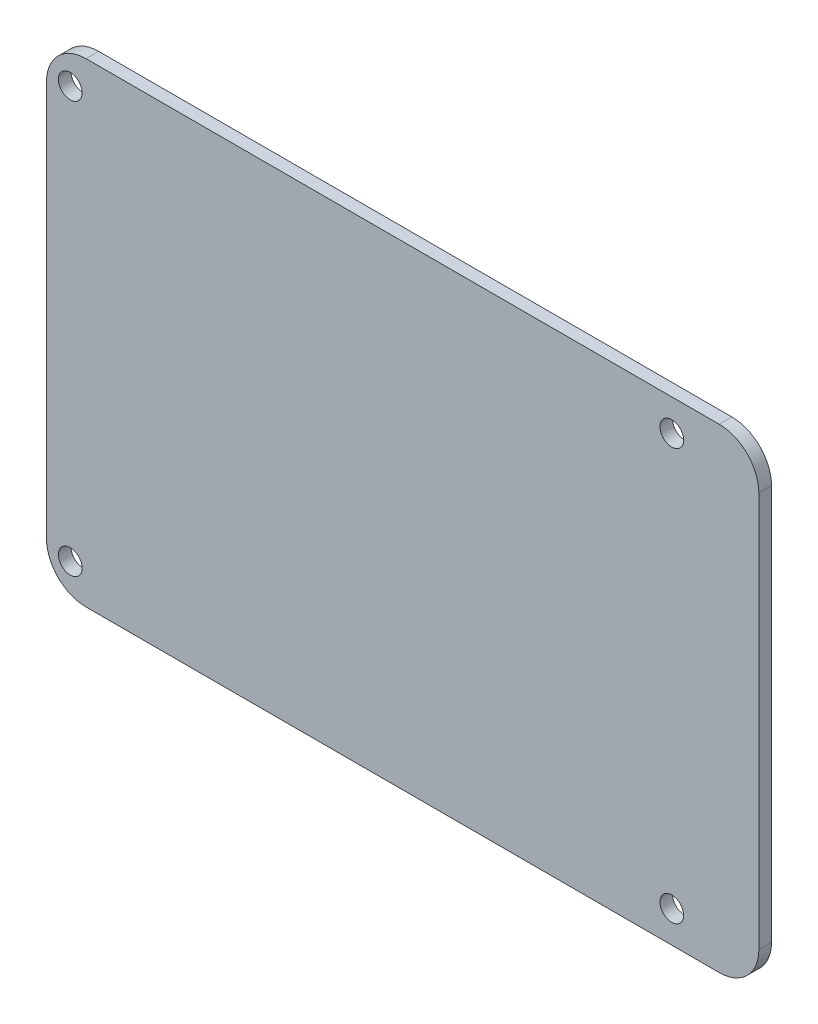
ISO-10303-21;
HEADER;
FILE_DESCRIPTION(('STEP AP214'),'2;1');
FILE_NAME('part.step','',(''),(''),'','','');
FILE_SCHEMA(('AUTOMOTIVE_DESIGN { 1 0 10303 214 1 1 1 1 }'));
ENDSEC;
DATA;
#1=APPLICATION_CONTEXT('core data for automotive mechanical design processes');
#2=APPLICATION_PROTOCOL_DEFINITION('international standard','automotive_design',2000,#1);
#3=PRODUCT_CONTEXT('',#1,'mechanical');
#4=PRODUCT('Part','Part','',(#3));
#5=PRODUCT_RELATED_PRODUCT_CATEGORY('part','',(#4));
#6=PRODUCT_DEFINITION_FORMATION('','',#4);
#7=PRODUCT_DEFINITION_CONTEXT('part definition',#1,'design');
#8=PRODUCT_DEFINITION('design','',#6,#7);
#9=PRODUCT_DEFINITION_SHAPE('','',#8);
#10=(LENGTH_UNIT() NAMED_UNIT(*) SI_UNIT(.MILLI.,.METRE.));
#11=(NAMED_UNIT(*) PLANE_ANGLE_UNIT() SI_UNIT($,.RADIAN.));
#12=(NAMED_UNIT(*) SI_UNIT($,.STERADIAN.) SOLID_ANGLE_UNIT());
#13=UNCERTAINTY_MEASURE_WITH_UNIT(LENGTH_MEASURE(1.E-05),#10,'distance_accuracy_value','');
#14=(GEOMETRIC_REPRESENTATION_CONTEXT(3) GLOBAL_UNCERTAINTY_ASSIGNED_CONTEXT((#13)) GLOBAL_UNIT_ASSIGNED_CONTEXT((#10,
#11,#12)) REPRESENTATION_CONTEXT('',''));
#15=CARTESIAN_POINT('',(0.,0.,0.));
#16=DIRECTION('',(0.,0.,1.));
#17=DIRECTION('',(1.,0.,0.));
#18=AXIS2_PLACEMENT_3D('',#15,#16,#17);
#19=CARTESIAN_POINT('',(0.,0.,1.6));
#20=DIRECTION('',(1.,0.,0.));
#21=DIRECTION('',(0.,0.,-1.));
#22=AXIS2_PLACEMENT_3D('',#19,#20,#21);
#23=PLANE('',#22);
#24=DIRECTION('',(0.,-1.,0.));
#25=VECTOR('',#24,1.);
#26=CARTESIAN_POINT('',(0.,0.,0.));
#27=LINE('',#26,#25);
#28=CARTESIAN_POINT('',(0.,55.,0.));
#29=VERTEX_POINT('',#28);
#30=CARTESIAN_POINT('',(0.,5.,0.));
#31=VERTEX_POINT('',#30);
#32=EDGE_CURVE('E131',#29,#31,#27,.T.);
#33=ORIENTED_EDGE('',*,*,#32,.T.);
#34=DIRECTION('',(0.,0.,-1.));
#35=VECTOR('',#34,1.);
#36=CARTESIAN_POINT('',(0.,5.,1.6));
#37=LINE('',#36,#35);
#38=CARTESIAN_POINT('',(0.,5.,1.6));
#39=VERTEX_POINT('',#38);
#40=EDGE_CURVE('E11',#31,#39,#37,.F.);
#41=ORIENTED_EDGE('',*,*,#40,.T.);
#42=DIRECTION('',(0.,-1.,0.));
#43=VECTOR('',#42,1.);
#44=CARTESIAN_POINT('',(0.,0.,1.6));
#45=LINE('',#44,#43);
#46=CARTESIAN_POINT('',(0.,55.,1.6));
#47=VERTEX_POINT('',#46);
#48=EDGE_CURVE('E129',#47,#39,#45,.T.);
#49=ORIENTED_EDGE('',*,*,#48,.F.);
#50=DIRECTION('',(0.,0.,-1.));
#51=VECTOR('',#50,1.);
#52=CARTESIAN_POINT('',(0.,55.,1.6));
#53=LINE('',#52,#51);
#54=EDGE_CURVE('E43',#47,#29,#53,.T.);
#55=ORIENTED_EDGE('',*,*,#54,.T.);
#56=EDGE_LOOP('',(#33,#41,#49,#55));
#57=FACE_BOUND('',#56,.T.);
#58=ADVANCED_FACE('F35',(#57),#23,.F.);
#59=CARTESIAN_POINT('',(0.,0.,1.6));
#60=DIRECTION('',(0.,1.,0.));
#61=DIRECTION('',(0.,0.,1.));
#62=AXIS2_PLACEMENT_3D('',#59,#60,#61);
#63=PLANE('',#62);
#64=DIRECTION('',(1.,0.,0.));
#65=VECTOR('',#64,1.);
#66=CARTESIAN_POINT('',(0.,0.,0.));
#67=LINE('',#66,#65);
#68=CARTESIAN_POINT('',(5.,0.,0.));
#69=VERTEX_POINT('',#68);
#70=CARTESIAN_POINT('',(85.,0.,0.));
#71=VERTEX_POINT('',#70);
#72=EDGE_CURVE('E127',#69,#71,#67,.T.);
#73=ORIENTED_EDGE('',*,*,#72,.T.);
#74=DIRECTION('',(0.,0.,-1.));
#75=VECTOR('',#74,1.);
#76=CARTESIAN_POINT('',(85.,0.,1.6));
#77=LINE('',#76,#75);
#78=CARTESIAN_POINT('',(85.,0.,1.6));
#79=VERTEX_POINT('',#78);
#80=EDGE_CURVE('E106',#71,#79,#77,.F.);
#81=ORIENTED_EDGE('',*,*,#80,.T.);
#82=DIRECTION('',(1.,0.,0.));
#83=VECTOR('',#82,1.);
#84=CARTESIAN_POINT('',(0.,0.,1.6));
#85=LINE('',#84,#83);
#86=CARTESIAN_POINT('',(5.,0.,1.6));
#87=VERTEX_POINT('',#86);
#88=EDGE_CURVE('E171',#87,#79,#85,.T.);
#89=ORIENTED_EDGE('',*,*,#88,.F.);
#90=DIRECTION('',(0.,0.,-1.));
#91=VECTOR('',#90,1.);
#92=CARTESIAN_POINT('',(5.,0.,1.6));
#93=LINE('',#92,#91);
#94=EDGE_CURVE('E111',#87,#69,#93,.T.);
#95=ORIENTED_EDGE('',*,*,#94,.T.);
#96=EDGE_LOOP('',(#73,#81,#89,#95));
#97=FACE_BOUND('',#96,.T.);
#98=ADVANCED_FACE('F211',(#97),#63,.F.);
#99=CARTESIAN_POINT('',(90.,0.,1.6));
#100=DIRECTION('',(-1.,0.,0.));
#101=DIRECTION('',(0.,-1.,0.));
#102=AXIS2_PLACEMENT_3D('',#99,#100,#101);
#103=PLANE('',#102);
#104=DIRECTION('',(0.,1.,0.));
#105=VECTOR('',#104,1.);
#106=CARTESIAN_POINT('',(90.,0.,1.6));
#107=LINE('',#106,#105);
#108=CARTESIAN_POINT('',(90.,5.,1.6));
#109=VERTEX_POINT('',#108);
#110=CARTESIAN_POINT('',(90.,55.,1.6));
#111=VERTEX_POINT('',#110);
#112=EDGE_CURVE('E120',#109,#111,#107,.T.);
#113=ORIENTED_EDGE('',*,*,#112,.F.);
#114=DIRECTION('',(0.,0.,-1.));
#115=VECTOR('',#114,1.);
#116=CARTESIAN_POINT('',(90.,5.,1.6));
#117=LINE('',#116,#115);
#118=CARTESIAN_POINT('',(90.,5.,0.));
#119=VERTEX_POINT('',#118);
#120=EDGE_CURVE('E105',#109,#119,#117,.T.);
#121=ORIENTED_EDGE('',*,*,#120,.T.);
#122=DIRECTION('',(0.,1.,0.));
#123=VECTOR('',#122,1.);
#124=CARTESIAN_POINT('',(90.,0.,0.));
#125=LINE('',#124,#123);
#126=CARTESIAN_POINT('',(90.,55.,0.));
#127=VERTEX_POINT('',#126);
#128=EDGE_CURVE('E118',#119,#127,#125,.T.);
#129=ORIENTED_EDGE('',*,*,#128,.T.);
#130=DIRECTION('',(0.,0.,-1.));
#131=VECTOR('',#130,1.);
#132=CARTESIAN_POINT('',(90.,55.,1.6));
#133=LINE('',#132,#131);
#134=EDGE_CURVE('E122',#127,#111,#133,.F.);
#135=ORIENTED_EDGE('',*,*,#134,.T.);
#136=EDGE_LOOP('',(#113,#121,#129,#135));
#137=FACE_BOUND('',#136,.T.);
#138=ADVANCED_FACE('F117',(#137),#103,.F.);
#139=CARTESIAN_POINT('',(0.,60.,1.6));
#140=DIRECTION('',(0.,-1.,0.));
#141=DIRECTION('',(0.,0.,-1.));
#142=AXIS2_PLACEMENT_3D('',#139,#140,#141);
#143=PLANE('',#142);
#144=DIRECTION('',(-1.,0.,0.));
#145=VECTOR('',#144,1.);
#146=CARTESIAN_POINT('',(0.,60.,1.6));
#147=LINE('',#146,#145);
#148=CARTESIAN_POINT('',(85.,60.,1.6));
#149=VERTEX_POINT('',#148);
#150=CARTESIAN_POINT('',(5.,60.,1.6));
#151=VERTEX_POINT('',#150);
#152=EDGE_CURVE('E135',#149,#151,#147,.T.);
#153=ORIENTED_EDGE('',*,*,#152,.F.);
#154=DIRECTION('',(0.,0.,-1.));
#155=VECTOR('',#154,1.);
#156=CARTESIAN_POINT('',(85.,60.,1.6));
#157=LINE('',#156,#155);
#158=CARTESIAN_POINT('',(85.,60.,0.));
#159=VERTEX_POINT('',#158);
#160=EDGE_CURVE('E152',#149,#159,#157,.T.);
#161=ORIENTED_EDGE('',*,*,#160,.T.);
#162=DIRECTION('',(-1.,0.,0.));
#163=VECTOR('',#162,1.);
#164=CARTESIAN_POINT('',(0.,60.,0.));
#165=LINE('',#164,#163);
#166=CARTESIAN_POINT('',(5.,60.,0.));
#167=VERTEX_POINT('',#166);
#168=EDGE_CURVE('E126',#159,#167,#165,.T.);
#169=ORIENTED_EDGE('',*,*,#168,.T.);
#170=DIRECTION('',(0.,0.,-1.));
#171=VECTOR('',#170,1.);
#172=CARTESIAN_POINT('',(5.,60.,1.6));
#173=LINE('',#172,#171);
#174=EDGE_CURVE('E50',#167,#151,#173,.F.);
#175=ORIENTED_EDGE('',*,*,#174,.T.);
#176=EDGE_LOOP('',(#153,#161,#169,#175));
#177=FACE_BOUND('',#176,.T.);
#178=ADVANCED_FACE('F236',(#177),#143,.F.);
#179=CARTESIAN_POINT('',(0.,0.,1.6));
#180=DIRECTION('',(0.,0.,-1.));
#181=DIRECTION('',(-1.,0.,0.));
#182=AXIS2_PLACEMENT_3D('',#179,#180,#181);
#183=PLANE('',#182);
#184=CARTESIAN_POINT('',(79.,4.,1.6));
#185=DIRECTION('',(0.,0.,-1.));
#186=DIRECTION('',(1.,0.,0.));
#187=AXIS2_PLACEMENT_3D('',#184,#185,#186);
#188=CIRCLE('',#187,1.5);
#189=CARTESIAN_POINT('',(80.5,4.,1.6));
#190=VERTEX_POINT('',#189);
#191=EDGE_CURVE('E187',#190,#190,#188,.T.);
#192=ORIENTED_EDGE('',*,*,#191,.T.);
#193=EDGE_LOOP('',(#192));
#194=FACE_BOUND('',#193,.T.);
#195=CARTESIAN_POINT('',(3.,4.,1.6));
#196=DIRECTION('',(0.,0.,-1.));
#197=DIRECTION('',(1.,0.,0.));
#198=AXIS2_PLACEMENT_3D('',#195,#196,#197);
#199=CIRCLE('',#198,1.5);
#200=CARTESIAN_POINT('',(4.5,4.,1.6));
#201=VERTEX_POINT('',#200);
#202=EDGE_CURVE('E188',#201,#201,#199,.T.);
#203=ORIENTED_EDGE('',*,*,#202,.T.);
#204=EDGE_LOOP('',(#203));
#205=FACE_BOUND('',#204,.T.);
#206=CARTESIAN_POINT('',(79.,56.,1.6));
#207=DIRECTION('',(0.,0.,1.));
#208=DIRECTION('',(1.,0.,0.));
#209=AXIS2_PLACEMENT_3D('',#206,#207,#208);
#210=CIRCLE('',#209,1.5);
#211=CARTESIAN_POINT('',(80.5,56.,1.6));
#212=VERTEX_POINT('',#211);
#213=EDGE_CURVE('E164',#212,#212,#210,.T.);
#214=ORIENTED_EDGE('',*,*,#213,.F.);
#215=EDGE_LOOP('',(#214));
#216=FACE_BOUND('',#215,.T.);
#217=CARTESIAN_POINT('',(3.,56.,1.6));
#218=DIRECTION('',(0.,0.,1.));
#219=DIRECTION('',(1.,0.,0.));
#220=AXIS2_PLACEMENT_3D('',#217,#218,#219);
#221=CIRCLE('',#220,1.5);
#222=CARTESIAN_POINT('',(4.5,56.,1.6));
#223=VERTEX_POINT('',#222);
#224=EDGE_CURVE('E175',#223,#223,#221,.T.);
#225=ORIENTED_EDGE('',*,*,#224,.F.);
#226=EDGE_LOOP('',(#225));
#227=FACE_BOUND('',#226,.T.);
#228=ORIENTED_EDGE('',*,*,#88,.T.);
#229=CARTESIAN_POINT('',(85.,5.,1.6));
#230=DIRECTION('',(0.,0.,-1.));
#231=DIRECTION('',(-1.,0.,0.));
#232=AXIS2_PLACEMENT_3D('',#229,#230,#231);
#233=CIRCLE('',#232,5.);
#234=EDGE_CURVE('E149',#79,#109,#233,.F.);
#235=ORIENTED_EDGE('',*,*,#234,.T.);
#236=ORIENTED_EDGE('',*,*,#112,.T.);
#237=CARTESIAN_POINT('',(85.,55.,1.6));
#238=DIRECTION('',(0.,0.,-1.));
#239=DIRECTION('',(-1.,0.,0.));
#240=AXIS2_PLACEMENT_3D('',#237,#238,#239);
#241=CIRCLE('',#240,5.);
#242=EDGE_CURVE('E57',#111,#149,#241,.F.);
#243=ORIENTED_EDGE('',*,*,#242,.T.);
#244=ORIENTED_EDGE('',*,*,#152,.T.);
#245=CARTESIAN_POINT('',(5.,55.,1.6));
#246=DIRECTION('',(0.,0.,-1.));
#247=DIRECTION('',(-1.,0.,0.));
#248=AXIS2_PLACEMENT_3D('',#245,#246,#247);
#249=CIRCLE('',#248,5.);
#250=EDGE_CURVE('E144',#151,#47,#249,.F.);
#251=ORIENTED_EDGE('',*,*,#250,.T.);
#252=ORIENTED_EDGE('',*,*,#48,.T.);
#253=CARTESIAN_POINT('',(5.,5.,1.6));
#254=DIRECTION('',(0.,0.,-1.));
#255=DIRECTION('',(-1.,0.,0.));
#256=AXIS2_PLACEMENT_3D('',#253,#254,#255);
#257=CIRCLE('',#256,5.);
#258=EDGE_CURVE('E146',#39,#87,#257,.F.);
#259=ORIENTED_EDGE('',*,*,#258,.T.);
#260=EDGE_LOOP('',(#228,#235,#236,#243,#244,#251,#252,#259));
#261=FACE_BOUND('',#260,.T.);
#262=ADVANCED_FACE('F196',(#194,#205,#216,#227,#261),#183,.F.);
#263=CARTESIAN_POINT('',(0.,0.,0.));
#264=DIRECTION('',(0.,0.,-1.));
#265=DIRECTION('',(-1.,0.,0.));
#266=AXIS2_PLACEMENT_3D('',#263,#264,#265);
#267=PLANE('',#266);
#268=CARTESIAN_POINT('',(79.,4.,0.));
#269=DIRECTION('',(0.,0.,-1.));
#270=DIRECTION('',(-1.,0.,0.));
#271=AXIS2_PLACEMENT_3D('',#268,#269,#270);
#272=CIRCLE('',#271,1.5);
#273=CARTESIAN_POINT('',(77.5,4.,0.));
#274=VERTEX_POINT('',#273);
#275=EDGE_CURVE('E179',#274,#274,#272,.T.);
#276=ORIENTED_EDGE('',*,*,#275,.F.);
#277=EDGE_LOOP('',(#276));
#278=FACE_BOUND('',#277,.T.);
#279=CARTESIAN_POINT('',(3.,4.,0.));
#280=DIRECTION('',(0.,0.,-1.));
#281=DIRECTION('',(-1.,0.,0.));
#282=AXIS2_PLACEMENT_3D('',#279,#280,#281);
#283=CIRCLE('',#282,1.5);
#284=CARTESIAN_POINT('',(1.5,4.,0.));
#285=VERTEX_POINT('',#284);
#286=EDGE_CURVE('E184',#285,#285,#283,.T.);
#287=ORIENTED_EDGE('',*,*,#286,.F.);
#288=EDGE_LOOP('',(#287));
#289=FACE_BOUND('',#288,.T.);
#290=CARTESIAN_POINT('',(79.,56.,0.));
#291=DIRECTION('',(0.,0.,-1.));
#292=DIRECTION('',(-1.,0.,0.));
#293=AXIS2_PLACEMENT_3D('',#290,#291,#292);
#294=CIRCLE('',#293,1.5);
#295=CARTESIAN_POINT('',(77.5,56.,0.));
#296=VERTEX_POINT('',#295);
#297=EDGE_CURVE('E166',#296,#296,#294,.F.);
#298=ORIENTED_EDGE('',*,*,#297,.T.);
#299=EDGE_LOOP('',(#298));
#300=FACE_BOUND('',#299,.T.);
#301=CARTESIAN_POINT('',(3.,56.,0.));
#302=DIRECTION('',(0.,0.,-1.));
#303=DIRECTION('',(-1.,0.,0.));
#304=AXIS2_PLACEMENT_3D('',#301,#302,#303);
#305=CIRCLE('',#304,1.5);
#306=CARTESIAN_POINT('',(1.5,56.,0.));
#307=VERTEX_POINT('',#306);
#308=EDGE_CURVE('E178',#307,#307,#305,.F.);
#309=ORIENTED_EDGE('',*,*,#308,.T.);
#310=EDGE_LOOP('',(#309));
#311=FACE_BOUND('',#310,.T.);
#312=ORIENTED_EDGE('',*,*,#128,.F.);
#313=CARTESIAN_POINT('',(85.,5.,0.));
#314=DIRECTION('',(0.,0.,-1.));
#315=DIRECTION('',(-1.,0.,0.));
#316=AXIS2_PLACEMENT_3D('',#313,#314,#315);
#317=CIRCLE('',#316,5.);
#318=EDGE_CURVE('E101',#119,#71,#317,.T.);
#319=ORIENTED_EDGE('',*,*,#318,.T.);
#320=ORIENTED_EDGE('',*,*,#72,.F.);
#321=CARTESIAN_POINT('',(5.,5.,0.));
#322=DIRECTION('',(0.,0.,-1.));
#323=DIRECTION('',(-1.,0.,0.));
#324=AXIS2_PLACEMENT_3D('',#321,#322,#323);
#325=CIRCLE('',#324,5.);
#326=EDGE_CURVE('E138',#69,#31,#325,.T.);
#327=ORIENTED_EDGE('',*,*,#326,.T.);
#328=ORIENTED_EDGE('',*,*,#32,.F.);
#329=CARTESIAN_POINT('',(5.,55.,0.));
#330=DIRECTION('',(0.,0.,-1.));
#331=DIRECTION('',(-1.,0.,0.));
#332=AXIS2_PLACEMENT_3D('',#329,#330,#331);
#333=CIRCLE('',#332,5.);
#334=EDGE_CURVE('E121',#29,#167,#333,.T.);
#335=ORIENTED_EDGE('',*,*,#334,.T.);
#336=ORIENTED_EDGE('',*,*,#168,.F.);
#337=CARTESIAN_POINT('',(85.,55.,0.));
#338=DIRECTION('',(0.,0.,-1.));
#339=DIRECTION('',(-1.,0.,0.));
#340=AXIS2_PLACEMENT_3D('',#337,#338,#339);
#341=CIRCLE('',#340,5.);
#342=EDGE_CURVE('E112',#159,#127,#341,.T.);
#343=ORIENTED_EDGE('',*,*,#342,.T.);
#344=EDGE_LOOP('',(#312,#319,#320,#327,#328,#335,#336,#343));
#345=FACE_BOUND('',#344,.T.);
#346=ADVANCED_FACE('F124',(#278,#289,#300,#311,#345),#267,.T.);
#347=CARTESIAN_POINT('',(85.,5.,1.6));
#348=DIRECTION('',(0.,0.,-1.));
#349=DIRECTION('',(-1.,0.,0.));
#350=AXIS2_PLACEMENT_3D('',#347,#348,#349);
#351=CYLINDRICAL_SURFACE('',#350,5.);
#352=ORIENTED_EDGE('',*,*,#234,.F.);
#353=ORIENTED_EDGE('',*,*,#80,.F.);
#354=ORIENTED_EDGE('',*,*,#318,.F.);
#355=ORIENTED_EDGE('',*,*,#120,.F.);
#356=EDGE_LOOP('',(#352,#353,#354,#355));
#357=FACE_BOUND('',#356,.T.);
#358=ADVANCED_FACE('F104',(#357),#351,.T.);
#359=CARTESIAN_POINT('',(85.,55.,1.6));
#360=DIRECTION('',(0.,0.,-1.));
#361=DIRECTION('',(-1.,0.,0.));
#362=AXIS2_PLACEMENT_3D('',#359,#360,#361);
#363=CYLINDRICAL_SURFACE('',#362,5.);
#364=ORIENTED_EDGE('',*,*,#242,.F.);
#365=ORIENTED_EDGE('',*,*,#134,.F.);
#366=ORIENTED_EDGE('',*,*,#342,.F.);
#367=ORIENTED_EDGE('',*,*,#160,.F.);
#368=EDGE_LOOP('',(#364,#365,#366,#367));
#369=FACE_BOUND('',#368,.T.);
#370=ADVANCED_FACE('F222',(#369),#363,.T.);
#371=CARTESIAN_POINT('',(5.,5.,1.6));
#372=DIRECTION('',(0.,0.,-1.));
#373=DIRECTION('',(-1.,0.,0.));
#374=AXIS2_PLACEMENT_3D('',#371,#372,#373);
#375=CYLINDRICAL_SURFACE('',#374,5.);
#376=ORIENTED_EDGE('',*,*,#258,.F.);
#377=ORIENTED_EDGE('',*,*,#40,.F.);
#378=ORIENTED_EDGE('',*,*,#326,.F.);
#379=ORIENTED_EDGE('',*,*,#94,.F.);
#380=EDGE_LOOP('',(#376,#377,#378,#379));
#381=FACE_BOUND('',#380,.T.);
#382=ADVANCED_FACE('F224',(#381),#375,.T.);
#383=CARTESIAN_POINT('',(5.,55.,1.6));
#384=DIRECTION('',(0.,0.,-1.));
#385=DIRECTION('',(-1.,0.,0.));
#386=AXIS2_PLACEMENT_3D('',#383,#384,#385);
#387=CYLINDRICAL_SURFACE('',#386,5.);
#388=ORIENTED_EDGE('',*,*,#250,.F.);
#389=ORIENTED_EDGE('',*,*,#174,.F.);
#390=ORIENTED_EDGE('',*,*,#334,.F.);
#391=ORIENTED_EDGE('',*,*,#54,.F.);
#392=EDGE_LOOP('',(#388,#389,#390,#391));
#393=FACE_BOUND('',#392,.T.);
#394=ADVANCED_FACE('F37',(#393),#387,.T.);
#395=CARTESIAN_POINT('',(3.,56.,-0.000999999999999916));
#396=DIRECTION('',(0.,0.,1.));
#397=DIRECTION('',(1.,0.,0.));
#398=AXIS2_PLACEMENT_3D('',#395,#396,#397);
#399=CYLINDRICAL_SURFACE('',#398,1.5);
#400=ORIENTED_EDGE('',*,*,#308,.F.);
#401=EDGE_LOOP('',(#400));
#402=FACE_BOUND('',#401,.T.);
#403=ORIENTED_EDGE('',*,*,#224,.T.);
#404=EDGE_LOOP('',(#403));
#405=FACE_BOUND('',#404,.T.);
#406=ADVANCED_FACE('F231',(#402,#405),#399,.F.);
#407=CARTESIAN_POINT('',(79.,56.,-0.000999999999999916));
#408=DIRECTION('',(0.,0.,1.));
#409=DIRECTION('',(1.,0.,0.));
#410=AXIS2_PLACEMENT_3D('',#407,#408,#409);
#411=CYLINDRICAL_SURFACE('',#410,1.5);
#412=ORIENTED_EDGE('',*,*,#297,.F.);
#413=EDGE_LOOP('',(#412));
#414=FACE_BOUND('',#413,.T.);
#415=ORIENTED_EDGE('',*,*,#213,.T.);
#416=EDGE_LOOP('',(#415));
#417=FACE_BOUND('',#416,.T.);
#418=ADVANCED_FACE('F207',(#414,#417),#411,.F.);
#419=CARTESIAN_POINT('',(3.,4.,-0.000999999999999916));
#420=DIRECTION('',(0.,0.,1.));
#421=DIRECTION('',(1.,0.,0.));
#422=AXIS2_PLACEMENT_3D('',#419,#420,#421);
#423=CYLINDRICAL_SURFACE('',#422,1.5);
#424=ORIENTED_EDGE('',*,*,#286,.T.);
#425=EDGE_LOOP('',(#424));
#426=FACE_BOUND('',#425,.T.);
#427=ORIENTED_EDGE('',*,*,#202,.F.);
#428=EDGE_LOOP('',(#427));
#429=FACE_BOUND('',#428,.T.);
#430=ADVANCED_FACE('F201',(#426,#429),#423,.F.);
#431=CARTESIAN_POINT('',(79.,4.,-0.000999999999999916));
#432=DIRECTION('',(0.,0.,1.));
#433=DIRECTION('',(1.,0.,0.));
#434=AXIS2_PLACEMENT_3D('',#431,#432,#433);
#435=CYLINDRICAL_SURFACE('',#434,1.5);
#436=ORIENTED_EDGE('',*,*,#275,.T.);
#437=EDGE_LOOP('',(#436));
#438=FACE_BOUND('',#437,.T.);
#439=ORIENTED_EDGE('',*,*,#191,.F.);
#440=EDGE_LOOP('',(#439));
#441=FACE_BOUND('',#440,.T.);
#442=ADVANCED_FACE('F199',(#438,#441),#435,.F.);
#443=CLOSED_SHELL('',(#58,#98,#138,#178,#262,#346,#358,#370,#382,#394,#406,#418,#430,#442));
#444=MANIFOLD_SOLID_BREP('B2',#443);
#445=ADVANCED_BREP_SHAPE_REPRESENTATION('',(#18,#444),#14);
#446=SHAPE_DEFINITION_REPRESENTATION(#9,#445);
ENDSEC;
END-ISO-10303-21;
